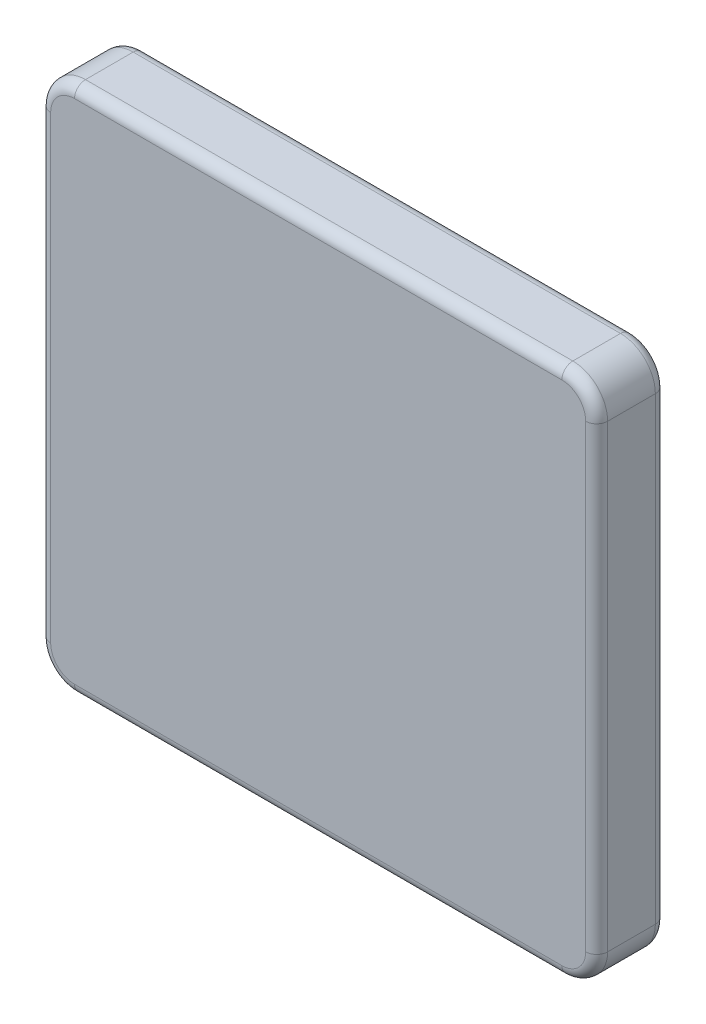
ISO-10303-21;
HEADER;
FILE_DESCRIPTION(('STEP AP214'),'2;1');
FILE_NAME('part.step','',(''),(''),'','','');
FILE_SCHEMA(('AUTOMOTIVE_DESIGN { 1 0 10303 214 1 1 1 1 }'));
ENDSEC;
DATA;
#1=APPLICATION_CONTEXT('core data for automotive mechanical design processes');
#2=APPLICATION_PROTOCOL_DEFINITION('international standard','automotive_design',2000,#1);
#3=PRODUCT_CONTEXT('',#1,'mechanical');
#4=PRODUCT('Part','Part','',(#3));
#5=PRODUCT_RELATED_PRODUCT_CATEGORY('part','',(#4));
#6=PRODUCT_DEFINITION_FORMATION('','',#4);
#7=PRODUCT_DEFINITION_CONTEXT('part definition',#1,'design');
#8=PRODUCT_DEFINITION('design','',#6,#7);
#9=PRODUCT_DEFINITION_SHAPE('','',#8);
#10=(LENGTH_UNIT() NAMED_UNIT(*) SI_UNIT(.MILLI.,.METRE.));
#11=(NAMED_UNIT(*) PLANE_ANGLE_UNIT() SI_UNIT($,.RADIAN.));
#12=(NAMED_UNIT(*) SI_UNIT($,.STERADIAN.) SOLID_ANGLE_UNIT());
#13=UNCERTAINTY_MEASURE_WITH_UNIT(LENGTH_MEASURE(1.E-05),#10,'distance_accuracy_value','');
#14=(GEOMETRIC_REPRESENTATION_CONTEXT(3) GLOBAL_UNCERTAINTY_ASSIGNED_CONTEXT((#13)) GLOBAL_UNIT_ASSIGNED_CONTEXT((#10,
#11,#12)) REPRESENTATION_CONTEXT('',''));
#15=CARTESIAN_POINT('',(0.,0.,0.));
#16=DIRECTION('',(0.,0.,1.));
#17=DIRECTION('',(1.,0.,0.));
#18=AXIS2_PLACEMENT_3D('',#15,#16,#17);
#19=CARTESIAN_POINT('',(0.,0.,254.));
#20=DIRECTION('',(1.,0.,0.));
#21=DIRECTION('',(0.,0.,-1.));
#22=AXIS2_PLACEMENT_3D('',#19,#20,#21);
#23=PLANE('',#22);
#24=DIRECTION('',(0.,0.,-1.));
#25=VECTOR('',#24,1.);
#26=CARTESIAN_POINT('',(0.,127.,254.));
#27=LINE('',#26,#25);
#28=CARTESIAN_POINT('',(0.,127.,40.));
#29=VERTEX_POINT('',#28);
#30=CARTESIAN_POINT('',(0.,127.,214.));
#31=VERTEX_POINT('',#30);
#32=EDGE_CURVE('E284',#29,#31,#27,.F.);
#33=ORIENTED_EDGE('',*,*,#32,.T.);
#34=DIRECTION('',(0.,-1.,0.));
#35=VECTOR('',#34,1.);
#36=CARTESIAN_POINT('',(0.,0.,214.));
#37=LINE('',#36,#35);
#38=CARTESIAN_POINT('',(0.,1803.4,214.));
#39=VERTEX_POINT('',#38);
#40=EDGE_CURVE('E11',#31,#39,#37,.F.);
#41=ORIENTED_EDGE('',*,*,#40,.T.);
#42=DIRECTION('',(0.,0.,-1.));
#43=VECTOR('',#42,1.);
#44=CARTESIAN_POINT('',(0.,1803.4,254.));
#45=LINE('',#44,#43);
#46=CARTESIAN_POINT('',(0.,1803.4,40.));
#47=VERTEX_POINT('',#46);
#48=EDGE_CURVE('E375',#39,#47,#45,.T.);
#49=ORIENTED_EDGE('',*,*,#48,.T.);
#50=DIRECTION('',(0.,-1.,0.));
#51=VECTOR('',#50,1.);
#52=CARTESIAN_POINT('',(0.,127.,40.));
#53=LINE('',#52,#51);
#54=EDGE_CURVE('E51',#47,#29,#53,.T.);
#55=ORIENTED_EDGE('',*,*,#54,.T.);
#56=EDGE_LOOP('',(#33,#41,#49,#55));
#57=FACE_BOUND('',#56,.T.);
#58=ADVANCED_FACE('F41',(#57),#23,.F.);
#59=CARTESIAN_POINT('',(0.,0.,254.));
#60=DIRECTION('',(0.,1.,0.));
#61=DIRECTION('',(0.,0.,1.));
#62=AXIS2_PLACEMENT_3D('',#59,#60,#61);
#63=PLANE('',#62);
#64=DIRECTION('',(0.,0.,-1.));
#65=VECTOR('',#64,1.);
#66=CARTESIAN_POINT('',(1905.,0.,254.));
#67=LINE('',#66,#65);
#68=CARTESIAN_POINT('',(1905.,0.,40.));
#69=VERTEX_POINT('',#68);
#70=CARTESIAN_POINT('',(1905.,0.,214.));
#71=VERTEX_POINT('',#70);
#72=EDGE_CURVE('E330',#69,#71,#67,.F.);
#73=ORIENTED_EDGE('',*,*,#72,.T.);
#74=DIRECTION('',(1.,0.,0.));
#75=VECTOR('',#74,1.);
#76=CARTESIAN_POINT('',(0.,0.,214.));
#77=LINE('',#76,#75);
#78=CARTESIAN_POINT('',(127.,0.,214.));
#79=VERTEX_POINT('',#78);
#80=EDGE_CURVE('E226',#71,#79,#77,.F.);
#81=ORIENTED_EDGE('',*,*,#80,.T.);
#82=DIRECTION('',(0.,0.,-1.));
#83=VECTOR('',#82,1.);
#84=CARTESIAN_POINT('',(127.,0.,254.));
#85=LINE('',#84,#83);
#86=CARTESIAN_POINT('',(127.,0.,40.));
#87=VERTEX_POINT('',#86);
#88=EDGE_CURVE('E340',#79,#87,#85,.T.);
#89=ORIENTED_EDGE('',*,*,#88,.T.);
#90=DIRECTION('',(1.,0.,0.));
#91=VECTOR('',#90,1.);
#92=CARTESIAN_POINT('',(1905.,0.,40.));
#93=LINE('',#92,#91);
#94=EDGE_CURVE('E223',#87,#69,#93,.T.);
#95=ORIENTED_EDGE('',*,*,#94,.T.);
#96=EDGE_LOOP('',(#73,#81,#89,#95));
#97=FACE_BOUND('',#96,.T.);
#98=ADVANCED_FACE('F390',(#97),#63,.F.);
#99=CARTESIAN_POINT('',(2032.,0.,254.));
#100=DIRECTION('',(-1.,0.,0.));
#101=DIRECTION('',(0.,0.,1.));
#102=AXIS2_PLACEMENT_3D('',#99,#100,#101);
#103=PLANE('',#102);
#104=DIRECTION('',(0.,0.,-1.));
#105=VECTOR('',#104,1.);
#106=CARTESIAN_POINT('',(2032.,1803.4,254.));
#107=LINE('',#106,#105);
#108=CARTESIAN_POINT('',(2032.,1803.4,40.));
#109=VERTEX_POINT('',#108);
#110=CARTESIAN_POINT('',(2032.,1803.4,214.));
#111=VERTEX_POINT('',#110);
#112=EDGE_CURVE('E337',#109,#111,#107,.F.);
#113=ORIENTED_EDGE('',*,*,#112,.T.);
#114=DIRECTION('',(0.,1.,0.));
#115=VECTOR('',#114,1.);
#116=CARTESIAN_POINT('',(2032.,0.,214.));
#117=LINE('',#116,#115);
#118=CARTESIAN_POINT('',(2032.,127.,214.));
#119=VERTEX_POINT('',#118);
#120=EDGE_CURVE('E214',#111,#119,#117,.F.);
#121=ORIENTED_EDGE('',*,*,#120,.T.);
#122=DIRECTION('',(0.,0.,-1.));
#123=VECTOR('',#122,1.);
#124=CARTESIAN_POINT('',(2032.,127.,254.));
#125=LINE('',#124,#123);
#126=CARTESIAN_POINT('',(2032.,127.,40.));
#127=VERTEX_POINT('',#126);
#128=EDGE_CURVE('E180',#119,#127,#125,.T.);
#129=ORIENTED_EDGE('',*,*,#128,.T.);
#130=DIRECTION('',(0.,1.,0.));
#131=VECTOR('',#130,1.);
#132=CARTESIAN_POINT('',(2032.,1803.4,40.));
#133=LINE('',#132,#131);
#134=EDGE_CURVE('E211',#127,#109,#133,.T.);
#135=ORIENTED_EDGE('',*,*,#134,.T.);
#136=EDGE_LOOP('',(#113,#121,#129,#135));
#137=FACE_BOUND('',#136,.T.);
#138=ADVANCED_FACE('F333',(#137),#103,.F.);
#139=CARTESIAN_POINT('',(0.,1930.4,254.));
#140=DIRECTION('',(0.,-1.,0.));
#141=DIRECTION('',(0.,0.,-1.));
#142=AXIS2_PLACEMENT_3D('',#139,#140,#141);
#143=PLANE('',#142);
#144=DIRECTION('',(0.,0.,-1.));
#145=VECTOR('',#144,1.);
#146=CARTESIAN_POINT('',(127.,1930.4,254.));
#147=LINE('',#146,#145);
#148=CARTESIAN_POINT('',(127.,1930.4,40.));
#149=VERTEX_POINT('',#148);
#150=CARTESIAN_POINT('',(127.,1930.4,214.));
#151=VERTEX_POINT('',#150);
#152=EDGE_CURVE('E373',#149,#151,#147,.F.);
#153=ORIENTED_EDGE('',*,*,#152,.T.);
#154=DIRECTION('',(-1.,0.,0.));
#155=VECTOR('',#154,1.);
#156=CARTESIAN_POINT('',(0.,1930.4,214.));
#157=LINE('',#156,#155);
#158=CARTESIAN_POINT('',(1905.,1930.4,214.));
#159=VERTEX_POINT('',#158);
#160=EDGE_CURVE('E202',#151,#159,#157,.F.);
#161=ORIENTED_EDGE('',*,*,#160,.T.);
#162=DIRECTION('',(0.,0.,-1.));
#163=VECTOR('',#162,1.);
#164=CARTESIAN_POINT('',(1905.,1930.4,254.));
#165=LINE('',#164,#163);
#166=CARTESIAN_POINT('',(1905.,1930.4,40.));
#167=VERTEX_POINT('',#166);
#168=EDGE_CURVE('E379',#159,#167,#165,.T.);
#169=ORIENTED_EDGE('',*,*,#168,.T.);
#170=DIRECTION('',(-1.,0.,0.));
#171=VECTOR('',#170,1.);
#172=CARTESIAN_POINT('',(127.,1930.4,40.));
#173=LINE('',#172,#171);
#174=EDGE_CURVE('E199',#167,#149,#173,.T.);
#175=ORIENTED_EDGE('',*,*,#174,.T.);
#176=EDGE_LOOP('',(#153,#161,#169,#175));
#177=FACE_BOUND('',#176,.T.);
#178=ADVANCED_FACE('F376',(#177),#143,.F.);
#179=CARTESIAN_POINT('',(0.,0.,254.));
#180=DIRECTION('',(0.,0.,-1.));
#181=DIRECTION('',(-1.,0.,0.));
#182=AXIS2_PLACEMENT_3D('',#179,#180,#181);
#183=PLANE('',#182);
#184=DIRECTION('',(-1.,0.,0.));
#185=VECTOR('',#184,1.);
#186=CARTESIAN_POINT('',(0.,1890.4,254.));
#187=LINE('',#186,#185);
#188=CARTESIAN_POINT('',(1905.,1890.4,254.));
#189=VERTEX_POINT('',#188);
#190=CARTESIAN_POINT('',(127.,1890.4,254.));
#191=VERTEX_POINT('',#190);
#192=EDGE_CURVE('E184',#189,#191,#187,.T.);
#193=ORIENTED_EDGE('',*,*,#192,.T.);
#194=CARTESIAN_POINT('',(127.,1803.4,254.));
#195=DIRECTION('',(0.,0.,-1.));
#196=DIRECTION('',(-1.,0.,0.));
#197=AXIS2_PLACEMENT_3D('',#194,#195,#196);
#198=CIRCLE('',#197,87.);
#199=CARTESIAN_POINT('',(40.,1803.4,254.));
#200=VERTEX_POINT('',#199);
#201=EDGE_CURVE('E163',#191,#200,#198,.F.);
#202=ORIENTED_EDGE('',*,*,#201,.T.);
#203=DIRECTION('',(0.,-1.,0.));
#204=VECTOR('',#203,1.);
#205=CARTESIAN_POINT('',(40.,0.,254.));
#206=LINE('',#205,#204);
#207=CARTESIAN_POINT('',(40.,127.,254.));
#208=VERTEX_POINT('',#207);
#209=EDGE_CURVE('E172',#200,#208,#206,.T.);
#210=ORIENTED_EDGE('',*,*,#209,.T.);
#211=CARTESIAN_POINT('',(127.,127.,254.));
#212=DIRECTION('',(0.,0.,-1.));
#213=DIRECTION('',(-1.,0.,0.));
#214=AXIS2_PLACEMENT_3D('',#211,#212,#213);
#215=CIRCLE('',#214,87.);
#216=CARTESIAN_POINT('',(127.,40.,254.));
#217=VERTEX_POINT('',#216);
#218=EDGE_CURVE('E179',#208,#217,#215,.F.);
#219=ORIENTED_EDGE('',*,*,#218,.T.);
#220=DIRECTION('',(1.,0.,0.));
#221=VECTOR('',#220,1.);
#222=CARTESIAN_POINT('',(0.,40.,254.));
#223=LINE('',#222,#221);
#224=CARTESIAN_POINT('',(1905.,40.,254.));
#225=VERTEX_POINT('',#224);
#226=EDGE_CURVE('E346',#217,#225,#223,.T.);
#227=ORIENTED_EDGE('',*,*,#226,.T.);
#228=CARTESIAN_POINT('',(1905.,127.,254.));
#229=DIRECTION('',(0.,0.,-1.));
#230=DIRECTION('',(-1.,0.,0.));
#231=AXIS2_PLACEMENT_3D('',#228,#229,#230);
#232=CIRCLE('',#231,87.);
#233=CARTESIAN_POINT('',(1992.,127.,254.));
#234=VERTEX_POINT('',#233);
#235=EDGE_CURVE('E349',#225,#234,#232,.F.);
#236=ORIENTED_EDGE('',*,*,#235,.T.);
#237=DIRECTION('',(0.,1.,0.));
#238=VECTOR('',#237,1.);
#239=CARTESIAN_POINT('',(1992.,0.,254.));
#240=LINE('',#239,#238);
#241=CARTESIAN_POINT('',(1992.,1803.4,254.));
#242=VERTEX_POINT('',#241);
#243=EDGE_CURVE('E352',#234,#242,#240,.T.);
#244=ORIENTED_EDGE('',*,*,#243,.T.);
#245=CARTESIAN_POINT('',(1905.,1803.4,254.));
#246=DIRECTION('',(0.,0.,-1.));
#247=DIRECTION('',(-1.,0.,0.));
#248=AXIS2_PLACEMENT_3D('',#245,#246,#247);
#249=CIRCLE('',#248,87.);
#250=EDGE_CURVE('E193',#242,#189,#249,.F.);
#251=ORIENTED_EDGE('',*,*,#250,.T.);
#252=EDGE_LOOP('',(#193,#202,#210,#219,#227,#236,#244,#251));
#253=FACE_BOUND('',#252,.T.);
#254=ADVANCED_FACE('F182',(#253),#183,.F.);
#255=CARTESIAN_POINT('',(0.,0.,0.));
#256=DIRECTION('',(0.,0.,-1.));
#257=DIRECTION('',(-1.,0.,0.));
#258=AXIS2_PLACEMENT_3D('',#255,#256,#257);
#259=PLANE('',#258);
#260=DIRECTION('',(0.,-1.,0.));
#261=VECTOR('',#260,1.);
#262=CARTESIAN_POINT('',(40.,1803.4,0.));
#263=LINE('',#262,#261);
#264=CARTESIAN_POINT('',(40.,127.,0.));
#265=VERTEX_POINT('',#264);
#266=CARTESIAN_POINT('',(40.,1803.4,0.));
#267=VERTEX_POINT('',#266);
#268=EDGE_CURVE('E235',#265,#267,#263,.F.);
#269=ORIENTED_EDGE('',*,*,#268,.T.);
#270=CARTESIAN_POINT('',(127.,1803.4,0.));
#271=DIRECTION('',(0.,0.,-1.));
#272=DIRECTION('',(-1.,0.,0.));
#273=AXIS2_PLACEMENT_3D('',#270,#271,#272);
#274=CIRCLE('',#273,87.);
#275=CARTESIAN_POINT('',(127.,1890.4,0.));
#276=VERTEX_POINT('',#275);
#277=EDGE_CURVE('E255',#267,#276,#274,.T.);
#278=ORIENTED_EDGE('',*,*,#277,.T.);
#279=DIRECTION('',(-1.,0.,0.));
#280=VECTOR('',#279,1.);
#281=CARTESIAN_POINT('',(1905.,1890.4,0.));
#282=LINE('',#281,#280);
#283=CARTESIAN_POINT('',(1905.,1890.4,0.));
#284=VERTEX_POINT('',#283);
#285=EDGE_CURVE('E66',#276,#284,#282,.F.);
#286=ORIENTED_EDGE('',*,*,#285,.T.);
#287=CARTESIAN_POINT('',(1905.,1803.4,0.));
#288=DIRECTION('',(0.,0.,-1.));
#289=DIRECTION('',(-1.,0.,0.));
#290=AXIS2_PLACEMENT_3D('',#287,#288,#289);
#291=CIRCLE('',#290,87.);
#292=CARTESIAN_POINT('',(1992.,1803.4,0.));
#293=VERTEX_POINT('',#292);
#294=EDGE_CURVE('E250',#284,#293,#291,.T.);
#295=ORIENTED_EDGE('',*,*,#294,.T.);
#296=DIRECTION('',(0.,1.,0.));
#297=VECTOR('',#296,1.);
#298=CARTESIAN_POINT('',(1992.,127.,0.));
#299=LINE('',#298,#297);
#300=CARTESIAN_POINT('',(1992.,127.,0.));
#301=VERTEX_POINT('',#300);
#302=EDGE_CURVE('E247',#293,#301,#299,.F.);
#303=ORIENTED_EDGE('',*,*,#302,.T.);
#304=CARTESIAN_POINT('',(1905.,127.,0.));
#305=DIRECTION('',(0.,0.,-1.));
#306=DIRECTION('',(-1.,0.,0.));
#307=AXIS2_PLACEMENT_3D('',#304,#305,#306);
#308=CIRCLE('',#307,87.);
#309=CARTESIAN_POINT('',(1905.,40.,0.));
#310=VERTEX_POINT('',#309);
#311=EDGE_CURVE('E244',#301,#310,#308,.T.);
#312=ORIENTED_EDGE('',*,*,#311,.T.);
#313=DIRECTION('',(1.,0.,0.));
#314=VECTOR('',#313,1.);
#315=CARTESIAN_POINT('',(127.,40.,0.));
#316=LINE('',#315,#314);
#317=CARTESIAN_POINT('',(127.,40.,0.));
#318=VERTEX_POINT('',#317);
#319=EDGE_CURVE('E241',#310,#318,#316,.F.);
#320=ORIENTED_EDGE('',*,*,#319,.T.);
#321=CARTESIAN_POINT('',(127.,127.,0.));
#322=DIRECTION('',(0.,0.,-1.));
#323=DIRECTION('',(-1.,0.,0.));
#324=AXIS2_PLACEMENT_3D('',#321,#322,#323);
#325=CIRCLE('',#324,87.);
#326=EDGE_CURVE('E238',#318,#265,#325,.T.);
#327=ORIENTED_EDGE('',*,*,#326,.T.);
#328=EDGE_LOOP('',(#269,#278,#286,#295,#303,#312,#320,#327));
#329=FACE_BOUND('',#328,.T.);
#330=ADVANCED_FACE('F417',(#329),#259,.T.);
#331=CARTESIAN_POINT('',(127.,1803.4,254.));
#332=DIRECTION('',(0.,0.,-1.));
#333=DIRECTION('',(-1.,0.,0.));
#334=AXIS2_PLACEMENT_3D('',#331,#332,#333);
#335=CYLINDRICAL_SURFACE('',#334,127.);
#336=ORIENTED_EDGE('',*,*,#48,.F.);
#337=CARTESIAN_POINT('',(127.,1803.4,214.));
#338=DIRECTION('',(0.,0.,-1.));
#339=DIRECTION('',(-1.,0.,0.));
#340=AXIS2_PLACEMENT_3D('',#337,#338,#339);
#341=CIRCLE('',#340,127.);
#342=EDGE_CURVE('E165',#39,#151,#341,.T.);
#343=ORIENTED_EDGE('',*,*,#342,.T.);
#344=ORIENTED_EDGE('',*,*,#152,.F.);
#345=CARTESIAN_POINT('',(127.,1803.4,40.));
#346=DIRECTION('',(0.,0.,-1.));
#347=DIRECTION('',(-1.,0.,0.));
#348=AXIS2_PLACEMENT_3D('',#345,#346,#347);
#349=CIRCLE('',#348,127.);
#350=EDGE_CURVE('E187',#149,#47,#349,.F.);
#351=ORIENTED_EDGE('',*,*,#350,.T.);
#352=EDGE_LOOP('',(#336,#343,#344,#351));
#353=FACE_BOUND('',#352,.T.);
#354=ADVANCED_FACE('F372',(#353),#335,.T.);
#355=CARTESIAN_POINT('',(127.,127.,254.));
#356=DIRECTION('',(0.,0.,-1.));
#357=DIRECTION('',(-1.,0.,0.));
#358=AXIS2_PLACEMENT_3D('',#355,#356,#357);
#359=CYLINDRICAL_SURFACE('',#358,127.);
#360=ORIENTED_EDGE('',*,*,#88,.F.);
#361=CARTESIAN_POINT('',(127.,127.,214.));
#362=DIRECTION('',(0.,0.,-1.));
#363=DIRECTION('',(-1.,0.,0.));
#364=AXIS2_PLACEMENT_3D('',#361,#362,#363);
#365=CIRCLE('',#364,127.);
#366=EDGE_CURVE('E232',#79,#31,#365,.T.);
#367=ORIENTED_EDGE('',*,*,#366,.T.);
#368=ORIENTED_EDGE('',*,*,#32,.F.);
#369=CARTESIAN_POINT('',(127.,127.,40.));
#370=DIRECTION('',(0.,0.,-1.));
#371=DIRECTION('',(-1.,0.,0.));
#372=AXIS2_PLACEMENT_3D('',#369,#370,#371);
#373=CIRCLE('',#372,127.);
#374=EDGE_CURVE('E229',#29,#87,#373,.F.);
#375=ORIENTED_EDGE('',*,*,#374,.T.);
#376=EDGE_LOOP('',(#360,#367,#368,#375));
#377=FACE_BOUND('',#376,.T.);
#378=ADVANCED_FACE('F394',(#377),#359,.T.);
#379=CARTESIAN_POINT('',(1905.,127.,254.));
#380=DIRECTION('',(0.,0.,-1.));
#381=DIRECTION('',(-1.,0.,0.));
#382=AXIS2_PLACEMENT_3D('',#379,#380,#381);
#383=CYLINDRICAL_SURFACE('',#382,127.);
#384=ORIENTED_EDGE('',*,*,#128,.F.);
#385=CARTESIAN_POINT('',(1905.,127.,214.));
#386=DIRECTION('',(0.,0.,-1.));
#387=DIRECTION('',(-1.,0.,0.));
#388=AXIS2_PLACEMENT_3D('',#385,#386,#387);
#389=CIRCLE('',#388,127.);
#390=EDGE_CURVE('E220',#119,#71,#389,.T.);
#391=ORIENTED_EDGE('',*,*,#390,.T.);
#392=ORIENTED_EDGE('',*,*,#72,.F.);
#393=CARTESIAN_POINT('',(1905.,127.,40.));
#394=DIRECTION('',(0.,0.,-1.));
#395=DIRECTION('',(-1.,0.,0.));
#396=AXIS2_PLACEMENT_3D('',#393,#394,#395);
#397=CIRCLE('',#396,127.);
#398=EDGE_CURVE('E217',#69,#127,#397,.F.);
#399=ORIENTED_EDGE('',*,*,#398,.T.);
#400=EDGE_LOOP('',(#384,#391,#392,#399));
#401=FACE_BOUND('',#400,.T.);
#402=ADVANCED_FACE('F327',(#401),#383,.T.);
#403=CARTESIAN_POINT('',(1905.,1803.4,254.));
#404=DIRECTION('',(0.,0.,-1.));
#405=DIRECTION('',(-1.,0.,0.));
#406=AXIS2_PLACEMENT_3D('',#403,#404,#405);
#407=CYLINDRICAL_SURFACE('',#406,127.);
#408=ORIENTED_EDGE('',*,*,#168,.F.);
#409=CARTESIAN_POINT('',(1905.,1803.4,214.));
#410=DIRECTION('',(0.,0.,-1.));
#411=DIRECTION('',(-1.,0.,0.));
#412=AXIS2_PLACEMENT_3D('',#409,#410,#411);
#413=CIRCLE('',#412,127.);
#414=EDGE_CURVE('E208',#159,#111,#413,.T.);
#415=ORIENTED_EDGE('',*,*,#414,.T.);
#416=ORIENTED_EDGE('',*,*,#112,.F.);
#417=CARTESIAN_POINT('',(1905.,1803.4,40.));
#418=DIRECTION('',(0.,0.,-1.));
#419=DIRECTION('',(-1.,0.,0.));
#420=AXIS2_PLACEMENT_3D('',#417,#418,#419);
#421=CIRCLE('',#420,127.);
#422=EDGE_CURVE('E205',#109,#167,#421,.F.);
#423=ORIENTED_EDGE('',*,*,#422,.T.);
#424=EDGE_LOOP('',(#408,#415,#416,#423));
#425=FACE_BOUND('',#424,.T.);
#426=ADVANCED_FACE('F425',(#425),#407,.T.);
#427=CARTESIAN_POINT('',(1905.,127.,214.));
#428=DIRECTION('',(0.,0.,-1.));
#429=DIRECTION('',(-1.,0.,0.));
#430=AXIS2_PLACEMENT_3D('',#427,#428,#429);
#431=TOROIDAL_SURFACE('',#430,87.,40.);
#432=CARTESIAN_POINT('',(1905.,40.,214.));
#433=DIRECTION('',(-1.,0.,0.));
#434=DIRECTION('',(0.,0.,1.));
#435=AXIS2_PLACEMENT_3D('',#432,#433,#434);
#436=CIRCLE('',#435,40.);
#437=EDGE_CURVE('E276',#71,#225,#436,.T.);
#438=ORIENTED_EDGE('',*,*,#437,.F.);
#439=ORIENTED_EDGE('',*,*,#390,.F.);
#440=CARTESIAN_POINT('',(1992.,127.,214.));
#441=DIRECTION('',(0.,1.,0.));
#442=DIRECTION('',(0.,0.,1.));
#443=AXIS2_PLACEMENT_3D('',#440,#441,#442);
#444=CIRCLE('',#443,40.);
#445=EDGE_CURVE('E280',#234,#119,#444,.T.);
#446=ORIENTED_EDGE('',*,*,#445,.F.);
#447=ORIENTED_EDGE('',*,*,#235,.F.);
#448=EDGE_LOOP('',(#438,#439,#446,#447));
#449=FACE_BOUND('',#448,.T.);
#450=ADVANCED_FACE('F432',(#449),#431,.T.);
#451=CARTESIAN_POINT('',(1992.,0.,214.));
#452=DIRECTION('',(0.,1.,0.));
#453=DIRECTION('',(0.,0.,1.));
#454=AXIS2_PLACEMENT_3D('',#451,#452,#453);
#455=CYLINDRICAL_SURFACE('',#454,40.);
#456=ORIENTED_EDGE('',*,*,#445,.T.);
#457=ORIENTED_EDGE('',*,*,#120,.F.);
#458=CARTESIAN_POINT('',(1992.,1803.4,214.));
#459=DIRECTION('',(0.,1.,0.));
#460=DIRECTION('',(0.,0.,1.));
#461=AXIS2_PLACEMENT_3D('',#458,#459,#460);
#462=CIRCLE('',#461,40.);
#463=EDGE_CURVE('E272',#242,#111,#462,.T.);
#464=ORIENTED_EDGE('',*,*,#463,.F.);
#465=ORIENTED_EDGE('',*,*,#243,.F.);
#466=EDGE_LOOP('',(#456,#457,#464,#465));
#467=FACE_BOUND('',#466,.T.);
#468=ADVANCED_FACE('F427',(#467),#455,.T.);
#469=CARTESIAN_POINT('',(0.,40.,214.));
#470=DIRECTION('',(1.,0.,0.));
#471=DIRECTION('',(0.,0.,-1.));
#472=AXIS2_PLACEMENT_3D('',#469,#470,#471);
#473=CYLINDRICAL_SURFACE('',#472,40.);
#474=ORIENTED_EDGE('',*,*,#437,.T.);
#475=ORIENTED_EDGE('',*,*,#226,.F.);
#476=CARTESIAN_POINT('',(127.,40.,214.));
#477=DIRECTION('',(-1.,0.,0.));
#478=DIRECTION('',(0.,0.,1.));
#479=AXIS2_PLACEMENT_3D('',#476,#477,#478);
#480=CIRCLE('',#479,40.);
#481=EDGE_CURVE('E268',#79,#217,#480,.T.);
#482=ORIENTED_EDGE('',*,*,#481,.F.);
#483=ORIENTED_EDGE('',*,*,#80,.F.);
#484=EDGE_LOOP('',(#474,#475,#482,#483));
#485=FACE_BOUND('',#484,.T.);
#486=ADVANCED_FACE('F401',(#485),#473,.T.);
#487=CARTESIAN_POINT('',(1905.,1803.4,214.));
#488=DIRECTION('',(0.,0.,-1.));
#489=DIRECTION('',(-1.,0.,0.));
#490=AXIS2_PLACEMENT_3D('',#487,#488,#489);
#491=TOROIDAL_SURFACE('',#490,87.,40.);
#492=ORIENTED_EDGE('',*,*,#463,.T.);
#493=ORIENTED_EDGE('',*,*,#414,.F.);
#494=CARTESIAN_POINT('',(1905.,1890.4,214.));
#495=DIRECTION('',(-1.,0.,0.));
#496=DIRECTION('',(0.,0.,1.));
#497=AXIS2_PLACEMENT_3D('',#494,#495,#496);
#498=CIRCLE('',#497,40.);
#499=EDGE_CURVE('E264',#189,#159,#498,.T.);
#500=ORIENTED_EDGE('',*,*,#499,.F.);
#501=ORIENTED_EDGE('',*,*,#250,.F.);
#502=EDGE_LOOP('',(#492,#493,#500,#501));
#503=FACE_BOUND('',#502,.T.);
#504=ADVANCED_FACE('F361',(#503),#491,.T.);
#505=CARTESIAN_POINT('',(127.,127.,214.));
#506=DIRECTION('',(0.,0.,-1.));
#507=DIRECTION('',(-1.,0.,0.));
#508=AXIS2_PLACEMENT_3D('',#505,#506,#507);
#509=TOROIDAL_SURFACE('',#508,87.,40.);
#510=ORIENTED_EDGE('',*,*,#481,.T.);
#511=ORIENTED_EDGE('',*,*,#218,.F.);
#512=CARTESIAN_POINT('',(40.,127.,214.));
#513=DIRECTION('',(0.,1.,0.));
#514=DIRECTION('',(0.,0.,1.));
#515=AXIS2_PLACEMENT_3D('',#512,#513,#514);
#516=CIRCLE('',#515,40.);
#517=EDGE_CURVE('E175',#31,#208,#516,.T.);
#518=ORIENTED_EDGE('',*,*,#517,.F.);
#519=ORIENTED_EDGE('',*,*,#366,.F.);
#520=EDGE_LOOP('',(#510,#511,#518,#519));
#521=FACE_BOUND('',#520,.T.);
#522=ADVANCED_FACE('F403',(#521),#509,.T.);
#523=CARTESIAN_POINT('',(0.,1890.4,214.));
#524=DIRECTION('',(-1.,0.,0.));
#525=DIRECTION('',(0.,0.,1.));
#526=AXIS2_PLACEMENT_3D('',#523,#524,#525);
#527=CYLINDRICAL_SURFACE('',#526,40.);
#528=ORIENTED_EDGE('',*,*,#499,.T.);
#529=ORIENTED_EDGE('',*,*,#160,.F.);
#530=CARTESIAN_POINT('',(127.,1890.4,214.));
#531=DIRECTION('',(-1.,0.,0.));
#532=DIRECTION('',(0.,0.,1.));
#533=AXIS2_PLACEMENT_3D('',#530,#531,#532);
#534=CIRCLE('',#533,40.);
#535=EDGE_CURVE('E169',#191,#151,#534,.T.);
#536=ORIENTED_EDGE('',*,*,#535,.F.);
#537=ORIENTED_EDGE('',*,*,#192,.F.);
#538=EDGE_LOOP('',(#528,#529,#536,#537));
#539=FACE_BOUND('',#538,.T.);
#540=ADVANCED_FACE('F364',(#539),#527,.T.);
#541=CARTESIAN_POINT('',(40.,0.,214.));
#542=DIRECTION('',(0.,-1.,0.));
#543=DIRECTION('',(0.,0.,-1.));
#544=AXIS2_PLACEMENT_3D('',#541,#542,#543);
#545=CYLINDRICAL_SURFACE('',#544,40.);
#546=ORIENTED_EDGE('',*,*,#517,.T.);
#547=ORIENTED_EDGE('',*,*,#209,.F.);
#548=CARTESIAN_POINT('',(40.,1803.4,214.));
#549=DIRECTION('',(0.,1.,0.));
#550=DIRECTION('',(0.,0.,1.));
#551=AXIS2_PLACEMENT_3D('',#548,#549,#550);
#552=CIRCLE('',#551,40.);
#553=EDGE_CURVE('E159',#39,#200,#552,.T.);
#554=ORIENTED_EDGE('',*,*,#553,.F.);
#555=ORIENTED_EDGE('',*,*,#40,.F.);
#556=EDGE_LOOP('',(#546,#547,#554,#555));
#557=FACE_BOUND('',#556,.T.);
#558=ADVANCED_FACE('F173',(#557),#545,.T.);
#559=CARTESIAN_POINT('',(127.,1803.4,214.));
#560=DIRECTION('',(0.,0.,-1.));
#561=DIRECTION('',(-1.,0.,0.));
#562=AXIS2_PLACEMENT_3D('',#559,#560,#561);
#563=TOROIDAL_SURFACE('',#562,87.,40.);
#564=ORIENTED_EDGE('',*,*,#535,.T.);
#565=ORIENTED_EDGE('',*,*,#342,.F.);
#566=ORIENTED_EDGE('',*,*,#553,.T.);
#567=ORIENTED_EDGE('',*,*,#201,.F.);
#568=EDGE_LOOP('',(#564,#565,#566,#567));
#569=FACE_BOUND('',#568,.T.);
#570=ADVANCED_FACE('F161',(#569),#563,.T.);
#571=CARTESIAN_POINT('',(1905.,127.,40.));
#572=DIRECTION('',(0.,0.,-1.));
#573=DIRECTION('',(-1.,0.,0.));
#574=AXIS2_PLACEMENT_3D('',#571,#572,#573);
#575=TOROIDAL_SURFACE('',#574,87.,40.);
#576=CARTESIAN_POINT('',(1992.,127.,40.));
#577=DIRECTION('',(0.,1.,0.));
#578=DIRECTION('',(0.,0.,1.));
#579=AXIS2_PLACEMENT_3D('',#576,#577,#578);
#580=CIRCLE('',#579,40.);
#581=EDGE_CURVE('E305',#127,#301,#580,.T.);
#582=ORIENTED_EDGE('',*,*,#581,.F.);
#583=ORIENTED_EDGE('',*,*,#398,.F.);
#584=CARTESIAN_POINT('',(1905.,40.,40.));
#585=DIRECTION('',(-1.,0.,0.));
#586=DIRECTION('',(0.,0.,1.));
#587=AXIS2_PLACEMENT_3D('',#584,#585,#586);
#588=CIRCLE('',#587,40.);
#589=EDGE_CURVE('E45',#310,#69,#588,.T.);
#590=ORIENTED_EDGE('',*,*,#589,.F.);
#591=ORIENTED_EDGE('',*,*,#311,.F.);
#592=EDGE_LOOP('',(#582,#583,#590,#591));
#593=FACE_BOUND('',#592,.T.);
#594=ADVANCED_FACE('F43',(#593),#575,.T.);
#595=CARTESIAN_POINT('',(0.,40.,40.));
#596=DIRECTION('',(-1.,0.,0.));
#597=DIRECTION('',(0.,0.,1.));
#598=AXIS2_PLACEMENT_3D('',#595,#596,#597);
#599=CYLINDRICAL_SURFACE('',#598,40.);
#600=ORIENTED_EDGE('',*,*,#589,.T.);
#601=ORIENTED_EDGE('',*,*,#94,.F.);
#602=CARTESIAN_POINT('',(127.,40.,40.));
#603=DIRECTION('',(-1.,0.,0.));
#604=DIRECTION('',(0.,0.,1.));
#605=AXIS2_PLACEMENT_3D('',#602,#603,#604);
#606=CIRCLE('',#605,40.);
#607=EDGE_CURVE('E302',#318,#87,#606,.T.);
#608=ORIENTED_EDGE('',*,*,#607,.F.);
#609=ORIENTED_EDGE('',*,*,#319,.F.);
#610=EDGE_LOOP('',(#600,#601,#608,#609));
#611=FACE_BOUND('',#610,.T.);
#612=ADVANCED_FACE('F318',(#611),#599,.T.);
#613=CARTESIAN_POINT('',(1992.,0.,40.));
#614=DIRECTION('',(0.,-1.,0.));
#615=DIRECTION('',(0.,0.,-1.));
#616=AXIS2_PLACEMENT_3D('',#613,#614,#615);
#617=CYLINDRICAL_SURFACE('',#616,40.);
#618=ORIENTED_EDGE('',*,*,#581,.T.);
#619=ORIENTED_EDGE('',*,*,#302,.F.);
#620=CARTESIAN_POINT('',(1992.,1803.4,40.));
#621=DIRECTION('',(0.,1.,0.));
#622=DIRECTION('',(0.,0.,1.));
#623=AXIS2_PLACEMENT_3D('',#620,#621,#622);
#624=CIRCLE('',#623,40.);
#625=EDGE_CURVE('E298',#109,#293,#624,.T.);
#626=ORIENTED_EDGE('',*,*,#625,.F.);
#627=ORIENTED_EDGE('',*,*,#134,.F.);
#628=EDGE_LOOP('',(#618,#619,#626,#627));
#629=FACE_BOUND('',#628,.T.);
#630=ADVANCED_FACE('F419',(#629),#617,.T.);
#631=CARTESIAN_POINT('',(127.,127.,40.));
#632=DIRECTION('',(0.,0.,-1.));
#633=DIRECTION('',(-1.,0.,0.));
#634=AXIS2_PLACEMENT_3D('',#631,#632,#633);
#635=TOROIDAL_SURFACE('',#634,87.,40.);
#636=ORIENTED_EDGE('',*,*,#607,.T.);
#637=ORIENTED_EDGE('',*,*,#374,.F.);
#638=CARTESIAN_POINT('',(40.,127.,40.));
#639=DIRECTION('',(0.,1.,0.));
#640=DIRECTION('',(0.,0.,1.));
#641=AXIS2_PLACEMENT_3D('',#638,#639,#640);
#642=CIRCLE('',#641,40.);
#643=EDGE_CURVE('E294',#265,#29,#642,.T.);
#644=ORIENTED_EDGE('',*,*,#643,.F.);
#645=ORIENTED_EDGE('',*,*,#326,.F.);
#646=EDGE_LOOP('',(#636,#637,#644,#645));
#647=FACE_BOUND('',#646,.T.);
#648=ADVANCED_FACE('F411',(#647),#635,.T.);
#649=CARTESIAN_POINT('',(1905.,1803.4,40.));
#650=DIRECTION('',(0.,0.,-1.));
#651=DIRECTION('',(-1.,0.,0.));
#652=AXIS2_PLACEMENT_3D('',#649,#650,#651);
#653=TOROIDAL_SURFACE('',#652,87.,40.);
#654=ORIENTED_EDGE('',*,*,#625,.T.);
#655=ORIENTED_EDGE('',*,*,#294,.F.);
#656=CARTESIAN_POINT('',(1905.,1890.4,40.));
#657=DIRECTION('',(-1.,0.,0.));
#658=DIRECTION('',(0.,0.,1.));
#659=AXIS2_PLACEMENT_3D('',#656,#657,#658);
#660=CIRCLE('',#659,40.);
#661=EDGE_CURVE('E290',#167,#284,#660,.T.);
#662=ORIENTED_EDGE('',*,*,#661,.F.);
#663=ORIENTED_EDGE('',*,*,#422,.F.);
#664=EDGE_LOOP('',(#654,#655,#662,#663));
#665=FACE_BOUND('',#664,.T.);
#666=ADVANCED_FACE('F422',(#665),#653,.T.);
#667=CARTESIAN_POINT('',(40.,0.,40.));
#668=DIRECTION('',(0.,1.,0.));
#669=DIRECTION('',(0.,0.,1.));
#670=AXIS2_PLACEMENT_3D('',#667,#668,#669);
#671=CYLINDRICAL_SURFACE('',#670,40.);
#672=ORIENTED_EDGE('',*,*,#643,.T.);
#673=ORIENTED_EDGE('',*,*,#54,.F.);
#674=CARTESIAN_POINT('',(40.,1803.4,40.));
#675=DIRECTION('',(0.,1.,0.));
#676=DIRECTION('',(0.,0.,1.));
#677=AXIS2_PLACEMENT_3D('',#674,#675,#676);
#678=CIRCLE('',#677,40.);
#679=EDGE_CURVE('E287',#267,#47,#678,.T.);
#680=ORIENTED_EDGE('',*,*,#679,.F.);
#681=ORIENTED_EDGE('',*,*,#268,.F.);
#682=EDGE_LOOP('',(#672,#673,#680,#681));
#683=FACE_BOUND('',#682,.T.);
#684=ADVANCED_FACE('F415',(#683),#671,.T.);
#685=CARTESIAN_POINT('',(0.,1890.4,40.));
#686=DIRECTION('',(1.,0.,0.));
#687=DIRECTION('',(0.,0.,-1.));
#688=AXIS2_PLACEMENT_3D('',#685,#686,#687);
#689=CYLINDRICAL_SURFACE('',#688,40.);
#690=ORIENTED_EDGE('',*,*,#661,.T.);
#691=ORIENTED_EDGE('',*,*,#285,.F.);
#692=CARTESIAN_POINT('',(127.,1890.4,40.));
#693=DIRECTION('',(-1.,0.,0.));
#694=DIRECTION('',(0.,0.,1.));
#695=AXIS2_PLACEMENT_3D('',#692,#693,#694);
#696=CIRCLE('',#695,40.);
#697=EDGE_CURVE('E59',#149,#276,#696,.T.);
#698=ORIENTED_EDGE('',*,*,#697,.F.);
#699=ORIENTED_EDGE('',*,*,#174,.F.);
#700=EDGE_LOOP('',(#690,#691,#698,#699));
#701=FACE_BOUND('',#700,.T.);
#702=ADVANCED_FACE('F525',(#701),#689,.T.);
#703=CARTESIAN_POINT('',(127.,1803.4,40.));
#704=DIRECTION('',(0.,0.,-1.));
#705=DIRECTION('',(-1.,0.,0.));
#706=AXIS2_PLACEMENT_3D('',#703,#704,#705);
#707=TOROIDAL_SURFACE('',#706,87.,40.);
#708=ORIENTED_EDGE('',*,*,#679,.T.);
#709=ORIENTED_EDGE('',*,*,#350,.F.);
#710=ORIENTED_EDGE('',*,*,#697,.T.);
#711=ORIENTED_EDGE('',*,*,#277,.F.);
#712=EDGE_LOOP('',(#708,#709,#710,#711));
#713=FACE_BOUND('',#712,.T.);
#714=ADVANCED_FACE('F532',(#713),#707,.T.);
#715=CLOSED_SHELL('',(#58,#98,#138,#178,#254,#330,#354,#378,#402,#426,#450,#468,#486,#504,#522,
#540,#558,#570,#594,#612,#630,#648,#666,#684,#702,#714));
#716=MANIFOLD_SOLID_BREP('B2',#715);
#717=ADVANCED_BREP_SHAPE_REPRESENTATION('',(#18,#716),#14);
#718=SHAPE_DEFINITION_REPRESENTATION(#9,#717);
ENDSEC;
END-ISO-10303-21;
